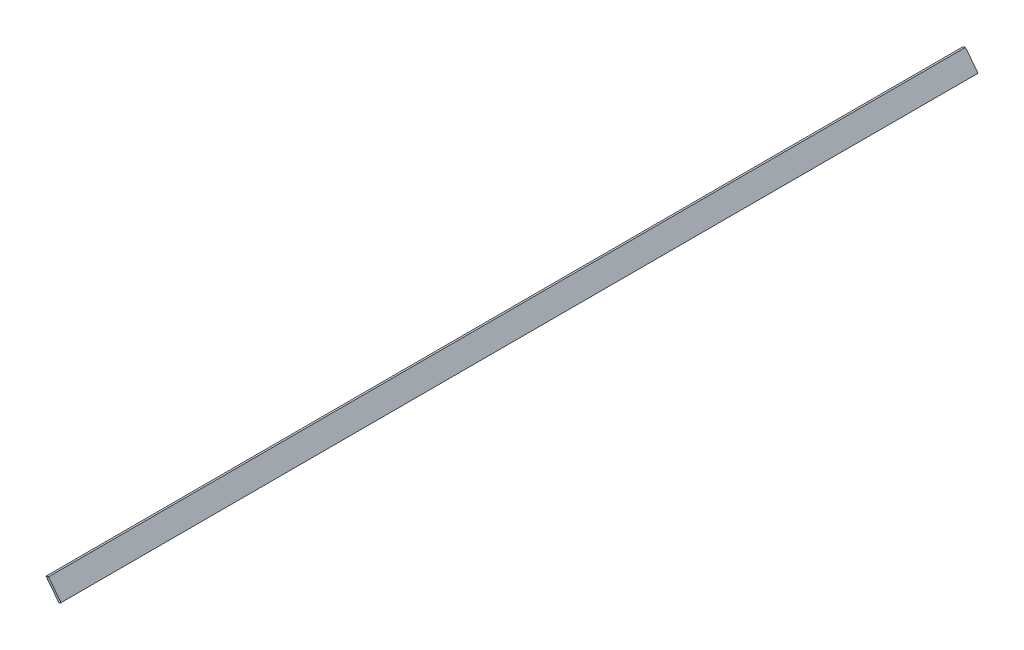
ISO-10303-21;
HEADER;
FILE_DESCRIPTION(('STEP AP214'),'2;1');
FILE_NAME('part.step','',(''),(''),'','','');
FILE_SCHEMA(('AUTOMOTIVE_DESIGN { 1 0 10303 214 1 1 1 1 }'));
ENDSEC;
DATA;
#1=APPLICATION_CONTEXT('core data for automotive mechanical design processes');
#2=APPLICATION_PROTOCOL_DEFINITION('international standard','automotive_design',2000,#1);
#3=PRODUCT_CONTEXT('',#1,'mechanical');
#4=PRODUCT('Part','Part','',(#3));
#5=PRODUCT_RELATED_PRODUCT_CATEGORY('part','',(#4));
#6=PRODUCT_DEFINITION_FORMATION('','',#4);
#7=PRODUCT_DEFINITION_CONTEXT('part definition',#1,'design');
#8=PRODUCT_DEFINITION('design','',#6,#7);
#9=PRODUCT_DEFINITION_SHAPE('','',#8);
#10=(LENGTH_UNIT() NAMED_UNIT(*) SI_UNIT(.MILLI.,.METRE.));
#11=(NAMED_UNIT(*) PLANE_ANGLE_UNIT() SI_UNIT($,.RADIAN.));
#12=(NAMED_UNIT(*) SI_UNIT($,.STERADIAN.) SOLID_ANGLE_UNIT());
#13=UNCERTAINTY_MEASURE_WITH_UNIT(LENGTH_MEASURE(1.E-05),#10,'distance_accuracy_value','');
#14=(GEOMETRIC_REPRESENTATION_CONTEXT(3) GLOBAL_UNCERTAINTY_ASSIGNED_CONTEXT((#13)) GLOBAL_UNIT_ASSIGNED_CONTEXT((#10,
#11,#12)) REPRESENTATION_CONTEXT('',''));
#15=CARTESIAN_POINT('',(0.,0.,0.));
#16=DIRECTION('',(0.,0.,1.));
#17=DIRECTION('',(1.,0.,0.));
#18=AXIS2_PLACEMENT_3D('',#15,#16,#17);
#19=CARTESIAN_POINT('',(-12.8910881292487,16.6814439076461,901.7));
#20=DIRECTION('',(0.791264771257286,0.611473680355217,0.));
#21=DIRECTION('',(-0.611473680355217,0.791264771257286,0.));
#22=AXIS2_PLACEMENT_3D('',#19,#20,#21);
#23=PLANE('',#22);
#24=DIRECTION('',(0.611473680355217,-0.791264771257286,0.));
#25=VECTOR('',#24,1.);
#26=CARTESIAN_POINT('',(-12.8910881292487,16.6814439076461,0.));
#27=LINE('',#26,#25);
#28=CARTESIAN_POINT('',(-12.8910881292487,16.6814439076461,0.));
#29=VERTEX_POINT('',#28);
#30=CARTESIAN_POINT('',(0.,0.,0.));
#31=VERTEX_POINT('',#30);
#32=EDGE_CURVE('E98',#29,#31,#27,.T.);
#33=ORIENTED_EDGE('',*,*,#32,.T.);
#34=DIRECTION('',(0.,0.,-1.));
#35=VECTOR('',#34,1.);
#36=CARTESIAN_POINT('',(0.,0.,901.7));
#37=LINE('',#36,#35);
#38=CARTESIAN_POINT('',(0.,0.,901.7));
#39=VERTEX_POINT('',#38);
#40=EDGE_CURVE('E11',#39,#31,#37,.T.);
#41=ORIENTED_EDGE('',*,*,#40,.F.);
#42=DIRECTION('',(0.611473680355217,-0.791264771257286,0.));
#43=VECTOR('',#42,1.);
#44=CARTESIAN_POINT('',(-12.8910881292487,16.6814439076461,901.7));
#45=LINE('',#44,#43);
#46=CARTESIAN_POINT('',(-12.8910881292487,16.6814439076461,901.7));
#47=VERTEX_POINT('',#46);
#48=EDGE_CURVE('E86',#47,#39,#45,.T.);
#49=ORIENTED_EDGE('',*,*,#48,.F.);
#50=DIRECTION('',(0.,0.,-1.));
#51=VECTOR('',#50,1.);
#52=CARTESIAN_POINT('',(-12.8910881292487,16.6814439076461,901.7));
#53=LINE('',#52,#51);
#54=EDGE_CURVE('E94',#47,#29,#53,.T.);
#55=ORIENTED_EDGE('',*,*,#54,.T.);
#56=EDGE_LOOP('',(#33,#41,#49,#55));
#57=FACE_BOUND('',#56,.T.);
#58=ADVANCED_FACE('F35',(#57),#23,.F.);
#59=CARTESIAN_POINT('',(0.,0.,901.7));
#60=DIRECTION('',(-0.61147368035522,0.791264771257284,0.));
#61=DIRECTION('',(-0.791264771257284,-0.61147368035522,0.));
#62=AXIS2_PLACEMENT_3D('',#59,#60,#61);
#63=PLANE('',#62);
#64=DIRECTION('',(0.791264771257284,0.61147368035522,0.));
#65=VECTOR('',#64,1.);
#66=CARTESIAN_POINT('',(0.,0.,0.));
#67=LINE('',#66,#65);
#68=CARTESIAN_POINT('',(1.86912564266396,1.4444231277351,0.));
#69=VERTEX_POINT('',#68);
#70=EDGE_CURVE('E90',#31,#69,#67,.T.);
#71=ORIENTED_EDGE('',*,*,#70,.T.);
#72=DIRECTION('',(0.,0.,-1.));
#73=VECTOR('',#72,1.);
#74=CARTESIAN_POINT('',(1.86912564266396,1.4444231277351,901.7));
#75=LINE('',#74,#73);
#76=CARTESIAN_POINT('',(1.86912564266396,1.4444231277351,901.7));
#77=VERTEX_POINT('',#76);
#78=EDGE_CURVE('E43',#77,#69,#75,.T.);
#79=ORIENTED_EDGE('',*,*,#78,.F.);
#80=DIRECTION('',(0.791264771257284,0.61147368035522,0.));
#81=VECTOR('',#80,1.);
#82=CARTESIAN_POINT('',(0.,0.,901.7));
#83=LINE('',#82,#81);
#84=EDGE_CURVE('E81',#39,#77,#83,.T.);
#85=ORIENTED_EDGE('',*,*,#84,.F.);
#86=ORIENTED_EDGE('',*,*,#40,.T.);
#87=EDGE_LOOP('',(#71,#79,#85,#86));
#88=FACE_BOUND('',#87,.T.);
#89=ADVANCED_FACE('F89',(#88),#63,.F.);
#90=CARTESIAN_POINT('',(1.86912564266396,1.4444231277351,901.7));
#91=DIRECTION('',(-0.791264771257286,-0.611473680355217,0.));
#92=DIRECTION('',(0.611473680355217,-0.791264771257286,0.));
#93=AXIS2_PLACEMENT_3D('',#90,#91,#92);
#94=PLANE('',#93);
#95=DIRECTION('',(-0.611473680355217,0.791264771257286,0.));
#96=VECTOR('',#95,1.);
#97=CARTESIAN_POINT('',(1.86912564266396,1.4444231277351,0.));
#98=LINE('',#97,#96);
#99=CARTESIAN_POINT('',(-10.4236628372715,17.3516498444105,0.));
#100=VERTEX_POINT('',#99);
#101=EDGE_CURVE('E68',#69,#100,#98,.T.);
#102=ORIENTED_EDGE('',*,*,#101,.T.);
#103=DIRECTION('',(0.,0.,-1.));
#104=VECTOR('',#103,1.);
#105=CARTESIAN_POINT('',(-10.4236628372715,17.3516498444105,901.7));
#106=LINE('',#105,#104);
#107=CARTESIAN_POINT('',(-10.4236628372715,17.3516498444105,901.7));
#108=VERTEX_POINT('',#107);
#109=EDGE_CURVE('E91',#108,#100,#106,.T.);
#110=ORIENTED_EDGE('',*,*,#109,.F.);
#111=DIRECTION('',(-0.611473680355217,0.791264771257286,0.));
#112=VECTOR('',#111,1.);
#113=CARTESIAN_POINT('',(1.86912564266396,1.4444231277351,901.7));
#114=LINE('',#113,#112);
#115=EDGE_CURVE('E84',#77,#108,#114,.T.);
#116=ORIENTED_EDGE('',*,*,#115,.F.);
#117=ORIENTED_EDGE('',*,*,#78,.T.);
#118=EDGE_LOOP('',(#102,#110,#116,#117));
#119=FACE_BOUND('',#118,.T.);
#120=ADVANCED_FACE('F92',(#119),#94,.F.);
#121=CARTESIAN_POINT('',(-10.4236628372715,17.3516498444105,901.7));
#122=DIRECTION('',(0.262124099375214,-0.965034173761081,0.));
#123=DIRECTION('',(0.965034173761081,0.262124099375214,0.));
#124=AXIS2_PLACEMENT_3D('',#121,#122,#123);
#125=PLANE('',#124);
#126=DIRECTION('',(-0.965034173761081,-0.262124099375214,0.));
#127=VECTOR('',#126,1.);
#128=CARTESIAN_POINT('',(-10.4236628372715,17.3516498444105,0.));
#129=LINE('',#128,#127);
#130=EDGE_CURVE('E74',#100,#29,#129,.T.);
#131=ORIENTED_EDGE('',*,*,#130,.T.);
#132=ORIENTED_EDGE('',*,*,#54,.F.);
#133=DIRECTION('',(-0.965034173761081,-0.262124099375214,0.));
#134=VECTOR('',#133,1.);
#135=CARTESIAN_POINT('',(-10.4236628372715,17.3516498444105,901.7));
#136=LINE('',#135,#134);
#137=EDGE_CURVE('E51',#108,#47,#136,.T.);
#138=ORIENTED_EDGE('',*,*,#137,.F.);
#139=ORIENTED_EDGE('',*,*,#109,.T.);
#140=EDGE_LOOP('',(#131,#132,#138,#139));
#141=FACE_BOUND('',#140,.T.);
#142=ADVANCED_FACE('F105',(#141),#125,.F.);
#143=CARTESIAN_POINT('',(0.,0.,901.7));
#144=DIRECTION('',(0.,0.,1.));
#145=DIRECTION('',(1.,0.,0.));
#146=AXIS2_PLACEMENT_3D('',#143,#144,#145);
#147=PLANE('',#146);
#148=ORIENTED_EDGE('',*,*,#48,.T.);
#149=ORIENTED_EDGE('',*,*,#84,.T.);
#150=ORIENTED_EDGE('',*,*,#115,.T.);
#151=ORIENTED_EDGE('',*,*,#137,.T.);
#152=EDGE_LOOP('',(#148,#149,#150,#151));
#153=FACE_BOUND('',#152,.T.);
#154=ADVANCED_FACE('F82',(#153),#147,.T.);
#155=CARTESIAN_POINT('',(0.,0.,0.));
#156=DIRECTION('',(0.,0.,1.));
#157=DIRECTION('',(1.,0.,0.));
#158=AXIS2_PLACEMENT_3D('',#155,#156,#157);
#159=PLANE('',#158);
#160=ORIENTED_EDGE('',*,*,#32,.F.);
#161=ORIENTED_EDGE('',*,*,#130,.F.);
#162=ORIENTED_EDGE('',*,*,#101,.F.);
#163=ORIENTED_EDGE('',*,*,#70,.F.);
#164=EDGE_LOOP('',(#160,#161,#162,#163));
#165=FACE_BOUND('',#164,.T.);
#166=ADVANCED_FACE('F108',(#165),#159,.F.);
#167=CLOSED_SHELL('',(#58,#89,#120,#142,#154,#166));
#168=MANIFOLD_SOLID_BREP('B2',#167);
#169=ADVANCED_BREP_SHAPE_REPRESENTATION('',(#18,#168),#14);
#170=SHAPE_DEFINITION_REPRESENTATION(#9,#169);
ENDSEC;
END-ISO-10303-21;
